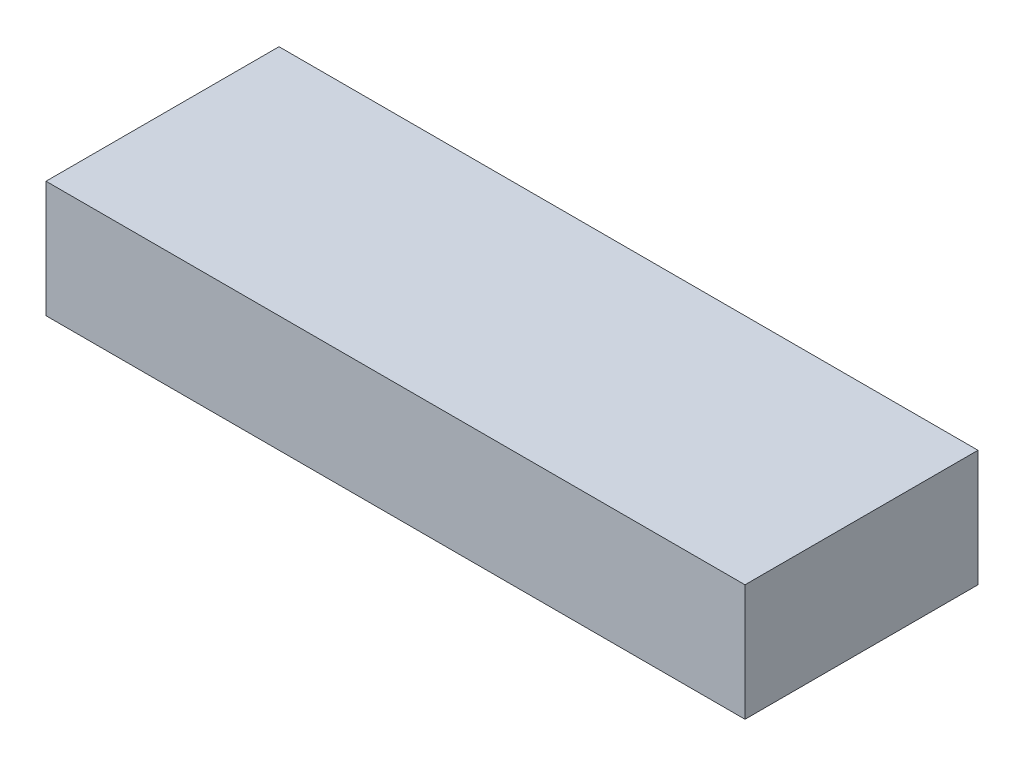
ISO-10303-21;
HEADER;
FILE_DESCRIPTION(('STEP AP214'),'2;1');
FILE_NAME('part.step','',(''),(''),'','','');
FILE_SCHEMA(('AUTOMOTIVE_DESIGN { 1 0 10303 214 1 1 1 1 }'));
ENDSEC;
DATA;
#1=APPLICATION_CONTEXT('core data for automotive mechanical design processes');
#2=APPLICATION_PROTOCOL_DEFINITION('international standard','automotive_design',2000,#1);
#3=PRODUCT_CONTEXT('',#1,'mechanical');
#4=PRODUCT('Part','Part','',(#3));
#5=PRODUCT_RELATED_PRODUCT_CATEGORY('part','',(#4));
#6=PRODUCT_DEFINITION_FORMATION('','',#4);
#7=PRODUCT_DEFINITION_CONTEXT('part definition',#1,'design');
#8=PRODUCT_DEFINITION('design','',#6,#7);
#9=PRODUCT_DEFINITION_SHAPE('','',#8);
#10=(LENGTH_UNIT() NAMED_UNIT(*) SI_UNIT(.MILLI.,.METRE.));
#11=(NAMED_UNIT(*) PLANE_ANGLE_UNIT() SI_UNIT($,.RADIAN.));
#12=(NAMED_UNIT(*) SI_UNIT($,.STERADIAN.) SOLID_ANGLE_UNIT());
#13=UNCERTAINTY_MEASURE_WITH_UNIT(LENGTH_MEASURE(1.E-05),#10,'distance_accuracy_value','');
#14=(GEOMETRIC_REPRESENTATION_CONTEXT(3) GLOBAL_UNCERTAINTY_ASSIGNED_CONTEXT((#13)) GLOBAL_UNIT_ASSIGNED_CONTEXT((#10,
#11,#12)) REPRESENTATION_CONTEXT('',''));
#15=CARTESIAN_POINT('',(0.,0.,0.));
#16=DIRECTION('',(0.,0.,1.));
#17=DIRECTION('',(1.,0.,0.));
#18=AXIS2_PLACEMENT_3D('',#15,#16,#17);
#19=CARTESIAN_POINT('',(-76.2,25.4,-25.4));
#20=DIRECTION('',(1.,0.,0.));
#21=DIRECTION('',(0.,0.,-1.));
#22=AXIS2_PLACEMENT_3D('',#19,#20,#21);
#23=PLANE('',#22);
#24=DIRECTION('',(0.,0.,1.));
#25=VECTOR('',#24,1.);
#26=CARTESIAN_POINT('',(-76.2,0.,-25.4));
#27=LINE('',#26,#25);
#28=CARTESIAN_POINT('',(-76.2,0.,-25.4));
#29=VERTEX_POINT('',#28);
#30=CARTESIAN_POINT('',(-76.2,0.,25.4));
#31=VERTEX_POINT('',#30);
#32=EDGE_CURVE('E98',#29,#31,#27,.T.);
#33=ORIENTED_EDGE('',*,*,#32,.T.);
#34=DIRECTION('',(0.,-1.,0.));
#35=VECTOR('',#34,1.);
#36=CARTESIAN_POINT('',(-76.2,25.4,25.4));
#37=LINE('',#36,#35);
#38=CARTESIAN_POINT('',(-76.2,25.4,25.4));
#39=VERTEX_POINT('',#38);
#40=EDGE_CURVE('E11',#39,#31,#37,.T.);
#41=ORIENTED_EDGE('',*,*,#40,.F.);
#42=DIRECTION('',(0.,0.,1.));
#43=VECTOR('',#42,1.);
#44=CARTESIAN_POINT('',(-76.2,25.4,-25.4));
#45=LINE('',#44,#43);
#46=CARTESIAN_POINT('',(-76.2,25.4,-25.4));
#47=VERTEX_POINT('',#46);
#48=EDGE_CURVE('E86',#47,#39,#45,.T.);
#49=ORIENTED_EDGE('',*,*,#48,.F.);
#50=DIRECTION('',(0.,-1.,0.));
#51=VECTOR('',#50,1.);
#52=CARTESIAN_POINT('',(-76.2,25.4,-25.4));
#53=LINE('',#52,#51);
#54=EDGE_CURVE('E94',#47,#29,#53,.T.);
#55=ORIENTED_EDGE('',*,*,#54,.T.);
#56=EDGE_LOOP('',(#33,#41,#49,#55));
#57=FACE_BOUND('',#56,.T.);
#58=ADVANCED_FACE('F35',(#57),#23,.F.);
#59=CARTESIAN_POINT('',(-76.2,25.4,25.4));
#60=DIRECTION('',(0.,0.,-1.));
#61=DIRECTION('',(-1.,0.,0.));
#62=AXIS2_PLACEMENT_3D('',#59,#60,#61);
#63=PLANE('',#62);
#64=DIRECTION('',(1.,0.,0.));
#65=VECTOR('',#64,1.);
#66=CARTESIAN_POINT('',(-76.2,0.,25.4));
#67=LINE('',#66,#65);
#68=CARTESIAN_POINT('',(76.2,0.,25.4));
#69=VERTEX_POINT('',#68);
#70=EDGE_CURVE('E90',#31,#69,#67,.T.);
#71=ORIENTED_EDGE('',*,*,#70,.T.);
#72=DIRECTION('',(0.,-1.,0.));
#73=VECTOR('',#72,1.);
#74=CARTESIAN_POINT('',(76.2,25.4,25.4));
#75=LINE('',#74,#73);
#76=CARTESIAN_POINT('',(76.2,25.4,25.4));
#77=VERTEX_POINT('',#76);
#78=EDGE_CURVE('E43',#77,#69,#75,.T.);
#79=ORIENTED_EDGE('',*,*,#78,.F.);
#80=DIRECTION('',(1.,0.,0.));
#81=VECTOR('',#80,1.);
#82=CARTESIAN_POINT('',(-76.2,25.4,25.4));
#83=LINE('',#82,#81);
#84=EDGE_CURVE('E81',#39,#77,#83,.T.);
#85=ORIENTED_EDGE('',*,*,#84,.F.);
#86=ORIENTED_EDGE('',*,*,#40,.T.);
#87=EDGE_LOOP('',(#71,#79,#85,#86));
#88=FACE_BOUND('',#87,.T.);
#89=ADVANCED_FACE('F89',(#88),#63,.F.);
#90=CARTESIAN_POINT('',(76.2,25.4,-25.4));
#91=DIRECTION('',(-1.,0.,0.));
#92=DIRECTION('',(0.,0.,1.));
#93=AXIS2_PLACEMENT_3D('',#90,#91,#92);
#94=PLANE('',#93);
#95=DIRECTION('',(0.,0.,-1.));
#96=VECTOR('',#95,1.);
#97=CARTESIAN_POINT('',(76.2,0.,-25.4));
#98=LINE('',#97,#96);
#99=CARTESIAN_POINT('',(76.2,0.,-25.4));
#100=VERTEX_POINT('',#99);
#101=EDGE_CURVE('E68',#69,#100,#98,.T.);
#102=ORIENTED_EDGE('',*,*,#101,.T.);
#103=DIRECTION('',(0.,-1.,0.));
#104=VECTOR('',#103,1.);
#105=CARTESIAN_POINT('',(76.2,25.4,-25.4));
#106=LINE('',#105,#104);
#107=CARTESIAN_POINT('',(76.2,25.4,-25.4));
#108=VERTEX_POINT('',#107);
#109=EDGE_CURVE('E91',#108,#100,#106,.T.);
#110=ORIENTED_EDGE('',*,*,#109,.F.);
#111=DIRECTION('',(0.,0.,-1.));
#112=VECTOR('',#111,1.);
#113=CARTESIAN_POINT('',(76.2,25.4,-25.4));
#114=LINE('',#113,#112);
#115=EDGE_CURVE('E84',#77,#108,#114,.T.);
#116=ORIENTED_EDGE('',*,*,#115,.F.);
#117=ORIENTED_EDGE('',*,*,#78,.T.);
#118=EDGE_LOOP('',(#102,#110,#116,#117));
#119=FACE_BOUND('',#118,.T.);
#120=ADVANCED_FACE('F92',(#119),#94,.F.);
#121=CARTESIAN_POINT('',(-76.2,25.4,-25.4));
#122=DIRECTION('',(0.,0.,1.));
#123=DIRECTION('',(1.,0.,0.));
#124=AXIS2_PLACEMENT_3D('',#121,#122,#123);
#125=PLANE('',#124);
#126=DIRECTION('',(-1.,0.,0.));
#127=VECTOR('',#126,1.);
#128=CARTESIAN_POINT('',(-76.2,0.,-25.4));
#129=LINE('',#128,#127);
#130=EDGE_CURVE('E74',#100,#29,#129,.T.);
#131=ORIENTED_EDGE('',*,*,#130,.T.);
#132=ORIENTED_EDGE('',*,*,#54,.F.);
#133=DIRECTION('',(-1.,0.,0.));
#134=VECTOR('',#133,1.);
#135=CARTESIAN_POINT('',(-76.2,25.4,-25.4));
#136=LINE('',#135,#134);
#137=EDGE_CURVE('E51',#108,#47,#136,.T.);
#138=ORIENTED_EDGE('',*,*,#137,.F.);
#139=ORIENTED_EDGE('',*,*,#109,.T.);
#140=EDGE_LOOP('',(#131,#132,#138,#139));
#141=FACE_BOUND('',#140,.T.);
#142=ADVANCED_FACE('F105',(#141),#125,.F.);
#143=CARTESIAN_POINT('',(0.,25.4,0.));
#144=DIRECTION('',(0.,1.,0.));
#145=DIRECTION('',(0.,0.,1.));
#146=AXIS2_PLACEMENT_3D('',#143,#144,#145);
#147=PLANE('',#146);
#148=ORIENTED_EDGE('',*,*,#48,.T.);
#149=ORIENTED_EDGE('',*,*,#84,.T.);
#150=ORIENTED_EDGE('',*,*,#115,.T.);
#151=ORIENTED_EDGE('',*,*,#137,.T.);
#152=EDGE_LOOP('',(#148,#149,#150,#151));
#153=FACE_BOUND('',#152,.T.);
#154=ADVANCED_FACE('F82',(#153),#147,.T.);
#155=CARTESIAN_POINT('',(0.,0.,0.));
#156=DIRECTION('',(0.,1.,0.));
#157=DIRECTION('',(0.,0.,1.));
#158=AXIS2_PLACEMENT_3D('',#155,#156,#157);
#159=PLANE('',#158);
#160=ORIENTED_EDGE('',*,*,#32,.F.);
#161=ORIENTED_EDGE('',*,*,#130,.F.);
#162=ORIENTED_EDGE('',*,*,#101,.F.);
#163=ORIENTED_EDGE('',*,*,#70,.F.);
#164=EDGE_LOOP('',(#160,#161,#162,#163));
#165=FACE_BOUND('',#164,.T.);
#166=ADVANCED_FACE('F108',(#165),#159,.F.);
#167=CLOSED_SHELL('',(#58,#89,#120,#142,#154,#166));
#168=MANIFOLD_SOLID_BREP('B2',#167);
#169=ADVANCED_BREP_SHAPE_REPRESENTATION('',(#18,#168),#14);
#170=SHAPE_DEFINITION_REPRESENTATION(#9,#169);
ENDSEC;
END-ISO-10303-21;
